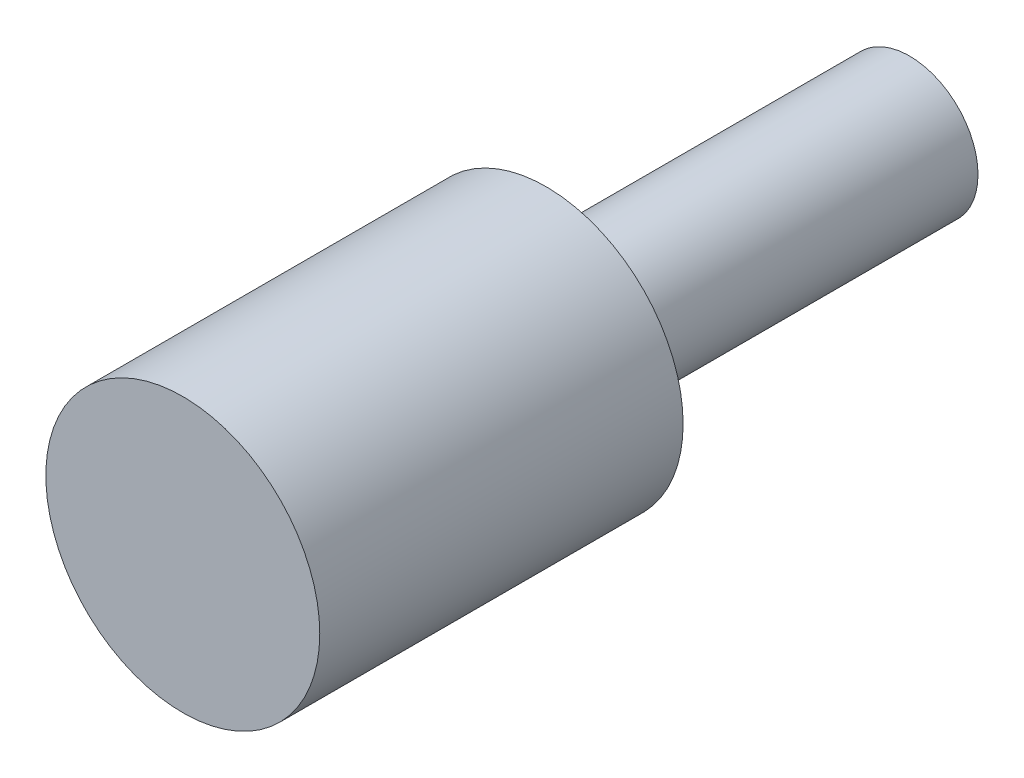
ISO-10303-21;
HEADER;
FILE_DESCRIPTION(('STEP AP214'),'2;1');
FILE_NAME('part.step','',(''),(''),'','','');
FILE_SCHEMA(('AUTOMOTIVE_DESIGN { 1 0 10303 214 1 1 1 1 }'));
ENDSEC;
DATA;
#1=APPLICATION_CONTEXT('core data for automotive mechanical design processes');
#2=APPLICATION_PROTOCOL_DEFINITION('international standard','automotive_design',2000,#1);
#3=PRODUCT_CONTEXT('',#1,'mechanical');
#4=PRODUCT('Part','Part','',(#3));
#5=PRODUCT_RELATED_PRODUCT_CATEGORY('part','',(#4));
#6=PRODUCT_DEFINITION_FORMATION('','',#4);
#7=PRODUCT_DEFINITION_CONTEXT('part definition',#1,'design');
#8=PRODUCT_DEFINITION('design','',#6,#7);
#9=PRODUCT_DEFINITION_SHAPE('','',#8);
#10=(LENGTH_UNIT() NAMED_UNIT(*) SI_UNIT(.MILLI.,.METRE.));
#11=(NAMED_UNIT(*) PLANE_ANGLE_UNIT() SI_UNIT($,.RADIAN.));
#12=(NAMED_UNIT(*) SI_UNIT($,.STERADIAN.) SOLID_ANGLE_UNIT());
#13=UNCERTAINTY_MEASURE_WITH_UNIT(LENGTH_MEASURE(1.E-05),#10,'distance_accuracy_value','');
#14=(GEOMETRIC_REPRESENTATION_CONTEXT(3) GLOBAL_UNCERTAINTY_ASSIGNED_CONTEXT((#13)) GLOBAL_UNIT_ASSIGNED_CONTEXT((#10,
#11,#12)) REPRESENTATION_CONTEXT('',''));
#15=CARTESIAN_POINT('',(0.,0.,0.));
#16=DIRECTION('',(0.,0.,1.));
#17=DIRECTION('',(1.,0.,0.));
#18=AXIS2_PLACEMENT_3D('',#15,#16,#17);
#19=CARTESIAN_POINT('',(0.,0.,33.02));
#20=DIRECTION('',(0.,0.,-1.));
#21=DIRECTION('',(-1.,0.,0.));
#22=AXIS2_PLACEMENT_3D('',#19,#20,#21);
#23=CYLINDRICAL_SURFACE('',#22,6.223);
#24=CARTESIAN_POINT('',(0.,0.,33.02));
#25=DIRECTION('',(0.,0.,1.));
#26=DIRECTION('',(1.,0.,0.));
#27=AXIS2_PLACEMENT_3D('',#24,#25,#26);
#28=CIRCLE('',#27,6.223);
#29=CARTESIAN_POINT('',(6.223,0.,33.02));
#30=VERTEX_POINT('',#29);
#31=EDGE_CURVE('E10',#30,#30,#28,.T.);
#32=ORIENTED_EDGE('',*,*,#31,.F.);
#33=EDGE_LOOP('',(#32));
#34=FACE_BOUND('',#33,.T.);
#35=CARTESIAN_POINT('',(0.,0.,0.));
#36=DIRECTION('',(0.,0.,1.));
#37=DIRECTION('',(1.,0.,0.));
#38=AXIS2_PLACEMENT_3D('',#35,#36,#37);
#39=CIRCLE('',#38,6.223);
#40=CARTESIAN_POINT('',(6.223,0.,0.));
#41=VERTEX_POINT('',#40);
#42=EDGE_CURVE('E33',#41,#41,#39,.T.);
#43=ORIENTED_EDGE('',*,*,#42,.T.);
#44=EDGE_LOOP('',(#43));
#45=FACE_BOUND('',#44,.T.);
#46=ADVANCED_FACE('F30',(#34,#45),#23,.T.);
#47=CARTESIAN_POINT('',(0.,0.,0.));
#48=DIRECTION('',(0.,0.,1.));
#49=DIRECTION('',(1.,0.,0.));
#50=AXIS2_PLACEMENT_3D('',#47,#48,#49);
#51=PLANE('',#50);
#52=ORIENTED_EDGE('',*,*,#42,.F.);
#53=EDGE_LOOP('',(#52));
#54=FACE_BOUND('',#53,.T.);
#55=ADVANCED_FACE('F53',(#54),#51,.F.);
#56=CARTESIAN_POINT('',(0.,0.,66.04));
#57=DIRECTION('',(0.,0.,-1.));
#58=DIRECTION('',(-1.,0.,0.));
#59=AXIS2_PLACEMENT_3D('',#56,#57,#58);
#60=CYLINDRICAL_SURFACE('',#59,12.446);
#61=CARTESIAN_POINT('',(0.,0.,66.04));
#62=DIRECTION('',(0.,0.,1.));
#63=DIRECTION('',(1.,0.,0.));
#64=AXIS2_PLACEMENT_3D('',#61,#62,#63);
#65=CIRCLE('',#64,12.446);
#66=CARTESIAN_POINT('',(12.446,0.,66.04));
#67=VERTEX_POINT('',#66);
#68=EDGE_CURVE('E40',#67,#67,#65,.T.);
#69=ORIENTED_EDGE('',*,*,#68,.F.);
#70=EDGE_LOOP('',(#69));
#71=FACE_BOUND('',#70,.T.);
#72=CARTESIAN_POINT('',(0.,0.,33.02));
#73=DIRECTION('',(0.,0.,1.));
#74=DIRECTION('',(1.,0.,0.));
#75=AXIS2_PLACEMENT_3D('',#72,#73,#74);
#76=CIRCLE('',#75,12.446);
#77=CARTESIAN_POINT('',(12.446,0.,33.02));
#78=VERTEX_POINT('',#77);
#79=EDGE_CURVE('E42',#78,#78,#76,.T.);
#80=ORIENTED_EDGE('',*,*,#79,.T.);
#81=EDGE_LOOP('',(#80));
#82=FACE_BOUND('',#81,.T.);
#83=ADVANCED_FACE('F50',(#71,#82),#60,.T.);
#84=CARTESIAN_POINT('',(0.,0.,66.04));
#85=DIRECTION('',(0.,0.,1.));
#86=DIRECTION('',(1.,0.,0.));
#87=AXIS2_PLACEMENT_3D('',#84,#85,#86);
#88=PLANE('',#87);
#89=ORIENTED_EDGE('',*,*,#68,.T.);
#90=EDGE_LOOP('',(#89));
#91=FACE_BOUND('',#90,.T.);
#92=ADVANCED_FACE('F48',(#91),#88,.T.);
#93=CARTESIAN_POINT('',(0.,0.,33.02));
#94=DIRECTION('',(0.,0.,1.));
#95=DIRECTION('',(1.,0.,0.));
#96=AXIS2_PLACEMENT_3D('',#93,#94,#95);
#97=PLANE('',#96);
#98=ORIENTED_EDGE('',*,*,#31,.T.);
#99=EDGE_LOOP('',(#98));
#100=FACE_BOUND('',#99,.T.);
#101=ORIENTED_EDGE('',*,*,#79,.F.);
#102=EDGE_LOOP('',(#101));
#103=FACE_BOUND('',#102,.T.);
#104=ADVANCED_FACE('F57',(#100,#103),#97,.F.);
#105=CLOSED_SHELL('',(#46,#55,#83,#92,#104));
#106=MANIFOLD_SOLID_BREP('B2',#105);
#107=ADVANCED_BREP_SHAPE_REPRESENTATION('',(#18,#106),#14);
#108=SHAPE_DEFINITION_REPRESENTATION(#9,#107);
ENDSEC;
END-ISO-10303-21;
